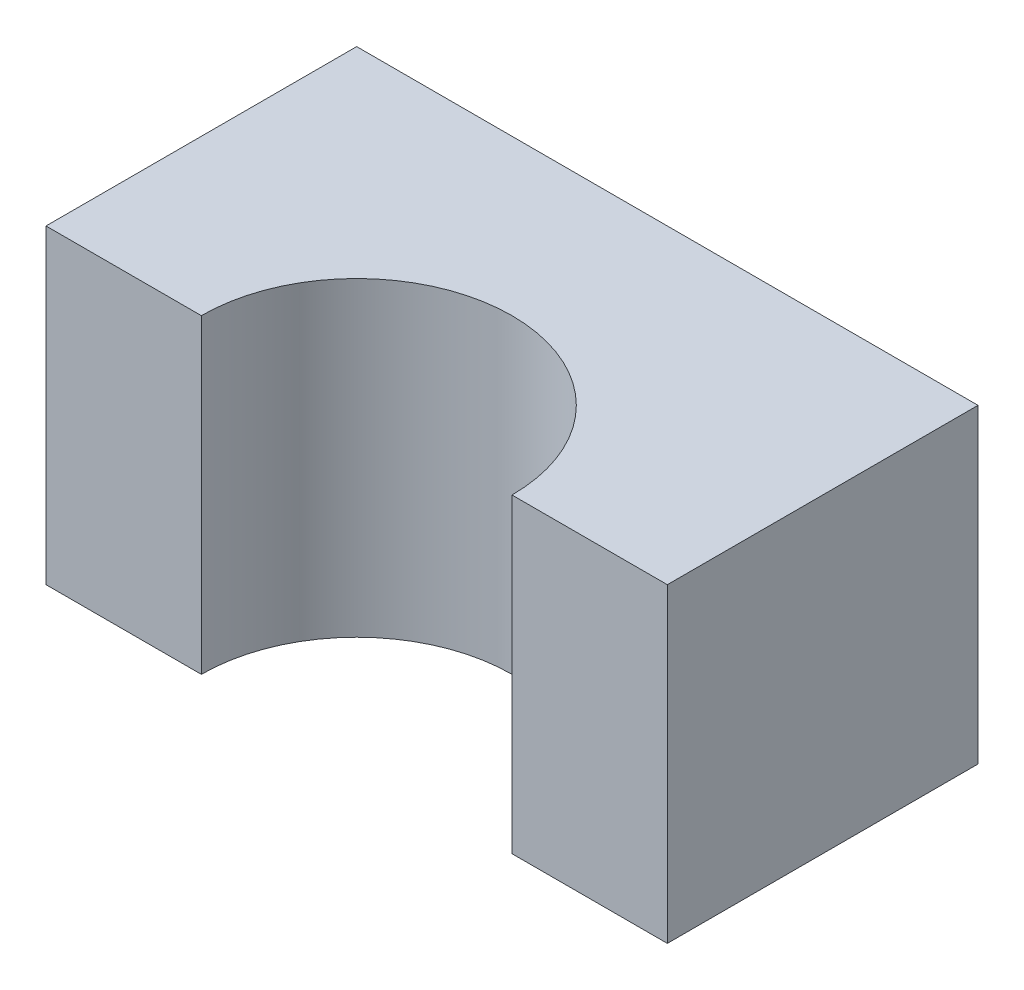
ISO-10303-21;
HEADER;
FILE_DESCRIPTION(('STEP AP214'),'2;1');
FILE_NAME('part.step','',(''),(''),'','','');
FILE_SCHEMA(('AUTOMOTIVE_DESIGN { 1 0 10303 214 1 1 1 1 }'));
ENDSEC;
DATA;
#1=APPLICATION_CONTEXT('core data for automotive mechanical design processes');
#2=APPLICATION_PROTOCOL_DEFINITION('international standard','automotive_design',2000,#1);
#3=PRODUCT_CONTEXT('',#1,'mechanical');
#4=PRODUCT('Part','Part','',(#3));
#5=PRODUCT_RELATED_PRODUCT_CATEGORY('part','',(#4));
#6=PRODUCT_DEFINITION_FORMATION('','',#4);
#7=PRODUCT_DEFINITION_CONTEXT('part definition',#1,'design');
#8=PRODUCT_DEFINITION('design','',#6,#7);
#9=PRODUCT_DEFINITION_SHAPE('','',#8);
#10=(LENGTH_UNIT() NAMED_UNIT(*) SI_UNIT(.MILLI.,.METRE.));
#11=(NAMED_UNIT(*) PLANE_ANGLE_UNIT() SI_UNIT($,.RADIAN.));
#12=(NAMED_UNIT(*) SI_UNIT($,.STERADIAN.) SOLID_ANGLE_UNIT());
#13=UNCERTAINTY_MEASURE_WITH_UNIT(LENGTH_MEASURE(1.E-05),#10,'distance_accuracy_value','');
#14=(GEOMETRIC_REPRESENTATION_CONTEXT(3) GLOBAL_UNCERTAINTY_ASSIGNED_CONTEXT((#13)) GLOBAL_UNIT_ASSIGNED_CONTEXT((#10,
#11,#12)) REPRESENTATION_CONTEXT('',''));
#15=CARTESIAN_POINT('',(0.,0.,0.));
#16=DIRECTION('',(0.,0.,1.));
#17=DIRECTION('',(1.,0.,0.));
#18=AXIS2_PLACEMENT_3D('',#15,#16,#17);
#19=CARTESIAN_POINT('',(-20.,20.,10.));
#20=DIRECTION('',(0.,0.,-1.));
#21=DIRECTION('',(-1.,0.,0.));
#22=AXIS2_PLACEMENT_3D('',#19,#20,#21);
#23=PLANE('',#22);
#24=DIRECTION('',(1.,0.,0.));
#25=VECTOR('',#24,1.);
#26=CARTESIAN_POINT('',(-20.,0.,10.));
#27=LINE('',#26,#25);
#28=CARTESIAN_POINT('',(-20.,0.,10.));
#29=VERTEX_POINT('',#28);
#30=CARTESIAN_POINT('',(-10.,0.,10.));
#31=VERTEX_POINT('',#30);
#32=EDGE_CURVE('E121',#29,#31,#27,.T.);
#33=ORIENTED_EDGE('',*,*,#32,.T.);
#34=DIRECTION('',(0.,1.,0.));
#35=VECTOR('',#34,1.);
#36=CARTESIAN_POINT('',(-10.,0.,10.));
#37=LINE('',#36,#35);
#38=CARTESIAN_POINT('',(-10.,20.,10.));
#39=VERTEX_POINT('',#38);
#40=EDGE_CURVE('E59',#31,#39,#37,.T.);
#41=ORIENTED_EDGE('',*,*,#40,.T.);
#42=DIRECTION('',(1.,0.,0.));
#43=VECTOR('',#42,1.);
#44=CARTESIAN_POINT('',(-20.,20.,10.));
#45=LINE('',#44,#43);
#46=CARTESIAN_POINT('',(-20.,20.,10.));
#47=VERTEX_POINT('',#46);
#48=EDGE_CURVE('E135',#47,#39,#45,.T.);
#49=ORIENTED_EDGE('',*,*,#48,.F.);
#50=DIRECTION('',(0.,-1.,0.));
#51=VECTOR('',#50,1.);
#52=CARTESIAN_POINT('',(-20.,20.,10.));
#53=LINE('',#52,#51);
#54=EDGE_CURVE('E134',#47,#29,#53,.T.);
#55=ORIENTED_EDGE('',*,*,#54,.T.);
#56=EDGE_LOOP('',(#33,#41,#49,#55));
#57=FACE_BOUND('',#56,.T.);
#58=ADVANCED_FACE('F43',(#57),#23,.F.);
#59=CARTESIAN_POINT('',(20.,20.,-10.));
#60=DIRECTION('',(-1.,0.,0.));
#61=DIRECTION('',(0.,0.,1.));
#62=AXIS2_PLACEMENT_3D('',#59,#60,#61);
#63=PLANE('',#62);
#64=DIRECTION('',(0.,0.,-1.));
#65=VECTOR('',#64,1.);
#66=CARTESIAN_POINT('',(20.,0.,-10.));
#67=LINE('',#66,#65);
#68=CARTESIAN_POINT('',(20.,0.,10.));
#69=VERTEX_POINT('',#68);
#70=CARTESIAN_POINT('',(20.,0.,-10.));
#71=VERTEX_POINT('',#70);
#72=EDGE_CURVE('E119',#69,#71,#67,.T.);
#73=ORIENTED_EDGE('',*,*,#72,.T.);
#74=DIRECTION('',(0.,-1.,0.));
#75=VECTOR('',#74,1.);
#76=CARTESIAN_POINT('',(20.,20.,-10.));
#77=LINE('',#76,#75);
#78=CARTESIAN_POINT('',(20.,20.,-10.));
#79=VERTEX_POINT('',#78);
#80=EDGE_CURVE('E11',#79,#71,#77,.T.);
#81=ORIENTED_EDGE('',*,*,#80,.F.);
#82=DIRECTION('',(0.,0.,-1.));
#83=VECTOR('',#82,1.);
#84=CARTESIAN_POINT('',(20.,20.,-10.));
#85=LINE('',#84,#83);
#86=CARTESIAN_POINT('',(20.,20.,10.));
#87=VERTEX_POINT('',#86);
#88=EDGE_CURVE('E126',#87,#79,#85,.T.);
#89=ORIENTED_EDGE('',*,*,#88,.F.);
#90=DIRECTION('',(0.,-1.,0.));
#91=VECTOR('',#90,1.);
#92=CARTESIAN_POINT('',(20.,20.,10.));
#93=LINE('',#92,#91);
#94=EDGE_CURVE('E131',#87,#69,#93,.T.);
#95=ORIENTED_EDGE('',*,*,#94,.T.);
#96=EDGE_LOOP('',(#73,#81,#89,#95));
#97=FACE_BOUND('',#96,.T.);
#98=ADVANCED_FACE('F45',(#97),#63,.F.);
#99=CARTESIAN_POINT('',(-20.,20.,-10.));
#100=DIRECTION('',(0.,0.,1.));
#101=DIRECTION('',(1.,0.,0.));
#102=AXIS2_PLACEMENT_3D('',#99,#100,#101);
#103=PLANE('',#102);
#104=DIRECTION('',(-1.,0.,0.));
#105=VECTOR('',#104,1.);
#106=CARTESIAN_POINT('',(-20.,0.,-10.));
#107=LINE('',#106,#105);
#108=CARTESIAN_POINT('',(-20.,0.,-10.));
#109=VERTEX_POINT('',#108);
#110=EDGE_CURVE('E127',#71,#109,#107,.T.);
#111=ORIENTED_EDGE('',*,*,#110,.T.);
#112=DIRECTION('',(0.,-1.,0.));
#113=VECTOR('',#112,1.);
#114=CARTESIAN_POINT('',(-20.,20.,-10.));
#115=LINE('',#114,#113);
#116=CARTESIAN_POINT('',(-20.,20.,-10.));
#117=VERTEX_POINT('',#116);
#118=EDGE_CURVE('E52',#117,#109,#115,.T.);
#119=ORIENTED_EDGE('',*,*,#118,.F.);
#120=DIRECTION('',(-1.,0.,0.));
#121=VECTOR('',#120,1.);
#122=CARTESIAN_POINT('',(-20.,20.,-10.));
#123=LINE('',#122,#121);
#124=EDGE_CURVE('E97',#79,#117,#123,.T.);
#125=ORIENTED_EDGE('',*,*,#124,.F.);
#126=ORIENTED_EDGE('',*,*,#80,.T.);
#127=EDGE_LOOP('',(#111,#119,#125,#126));
#128=FACE_BOUND('',#127,.T.);
#129=ADVANCED_FACE('F157',(#128),#103,.F.);
#130=CARTESIAN_POINT('',(-20.,20.,-10.));
#131=DIRECTION('',(1.,0.,0.));
#132=DIRECTION('',(0.,0.,-1.));
#133=AXIS2_PLACEMENT_3D('',#130,#131,#132);
#134=PLANE('',#133);
#135=DIRECTION('',(0.,0.,1.));
#136=VECTOR('',#135,1.);
#137=CARTESIAN_POINT('',(-20.,0.,-10.));
#138=LINE('',#137,#136);
#139=EDGE_CURVE('E122',#109,#29,#138,.T.);
#140=ORIENTED_EDGE('',*,*,#139,.T.);
#141=ORIENTED_EDGE('',*,*,#54,.F.);
#142=DIRECTION('',(0.,0.,1.));
#143=VECTOR('',#142,1.);
#144=CARTESIAN_POINT('',(-20.,20.,-10.));
#145=LINE('',#144,#143);
#146=EDGE_CURVE('E145',#117,#47,#145,.T.);
#147=ORIENTED_EDGE('',*,*,#146,.F.);
#148=ORIENTED_EDGE('',*,*,#118,.T.);
#149=EDGE_LOOP('',(#140,#141,#147,#148));
#150=FACE_BOUND('',#149,.T.);
#151=ADVANCED_FACE('F143',(#150),#134,.F.);
#152=CARTESIAN_POINT('',(10.,20.,10.));
#153=VERTEX_POINT('',#152);
#154=EDGE_CURVE('E68',#153,#87,#45,.T.);
#155=ORIENTED_EDGE('',*,*,#154,.F.);
#156=DIRECTION('',(0.,1.,0.));
#157=VECTOR('',#156,1.);
#158=CARTESIAN_POINT('',(10.,0.,10.));
#159=LINE('',#158,#157);
#160=CARTESIAN_POINT('',(10.,0.,10.));
#161=VERTEX_POINT('',#160);
#162=EDGE_CURVE('E106',#153,#161,#159,.F.);
#163=ORIENTED_EDGE('',*,*,#162,.T.);
#164=EDGE_CURVE('E90',#161,#69,#27,.T.);
#165=ORIENTED_EDGE('',*,*,#164,.T.);
#166=ORIENTED_EDGE('',*,*,#94,.F.);
#167=EDGE_LOOP('',(#155,#163,#165,#166));
#168=FACE_BOUND('',#167,.T.);
#169=ADVANCED_FACE('F113',(#168),#23,.F.);
#170=CARTESIAN_POINT('',(0.,20.,0.));
#171=DIRECTION('',(0.,1.,0.));
#172=DIRECTION('',(0.,0.,1.));
#173=AXIS2_PLACEMENT_3D('',#170,#171,#172);
#174=PLANE('',#173);
#175=CARTESIAN_POINT('',(0.,20.,10.));
#176=DIRECTION('',(0.,1.,0.));
#177=DIRECTION('',(0.,0.,1.));
#178=AXIS2_PLACEMENT_3D('',#175,#176,#177);
#179=CIRCLE('',#178,10.);
#180=EDGE_CURVE('E111',#153,#39,#179,.T.);
#181=ORIENTED_EDGE('',*,*,#180,.F.);
#182=ORIENTED_EDGE('',*,*,#154,.T.);
#183=ORIENTED_EDGE('',*,*,#88,.T.);
#184=ORIENTED_EDGE('',*,*,#124,.T.);
#185=ORIENTED_EDGE('',*,*,#146,.T.);
#186=ORIENTED_EDGE('',*,*,#48,.T.);
#187=EDGE_LOOP('',(#181,#182,#183,#184,#185,#186));
#188=FACE_BOUND('',#187,.T.);
#189=ADVANCED_FACE('F168',(#188),#174,.T.);
#190=CARTESIAN_POINT('',(0.,0.,0.));
#191=DIRECTION('',(0.,1.,0.));
#192=DIRECTION('',(0.,0.,1.));
#193=AXIS2_PLACEMENT_3D('',#190,#191,#192);
#194=PLANE('',#193);
#195=ORIENTED_EDGE('',*,*,#164,.F.);
#196=CARTESIAN_POINT('',(0.,0.,10.));
#197=DIRECTION('',(0.,1.,0.));
#198=DIRECTION('',(0.,0.,1.));
#199=AXIS2_PLACEMENT_3D('',#196,#197,#198);
#200=CIRCLE('',#199,10.);
#201=EDGE_CURVE('E104',#161,#31,#200,.T.);
#202=ORIENTED_EDGE('',*,*,#201,.T.);
#203=ORIENTED_EDGE('',*,*,#32,.F.);
#204=ORIENTED_EDGE('',*,*,#139,.F.);
#205=ORIENTED_EDGE('',*,*,#110,.F.);
#206=ORIENTED_EDGE('',*,*,#72,.F.);
#207=EDGE_LOOP('',(#195,#202,#203,#204,#205,#206));
#208=FACE_BOUND('',#207,.T.);
#209=ADVANCED_FACE('F117',(#208),#194,.F.);
#210=CARTESIAN_POINT('',(0.,0.,10.));
#211=DIRECTION('',(0.,1.,0.));
#212=DIRECTION('',(0.,0.,1.));
#213=AXIS2_PLACEMENT_3D('',#210,#211,#212);
#214=CYLINDRICAL_SURFACE('',#213,10.);
#215=ORIENTED_EDGE('',*,*,#201,.F.);
#216=ORIENTED_EDGE('',*,*,#162,.F.);
#217=ORIENTED_EDGE('',*,*,#180,.T.);
#218=ORIENTED_EDGE('',*,*,#40,.F.);
#219=EDGE_LOOP('',(#215,#216,#217,#218));
#220=FACE_BOUND('',#219,.T.);
#221=ADVANCED_FACE('F105',(#220),#214,.F.);
#222=CLOSED_SHELL('',(#58,#98,#129,#151,#169,#189,#209,#221));
#223=MANIFOLD_SOLID_BREP('B2',#222);
#224=ADVANCED_BREP_SHAPE_REPRESENTATION('',(#18,#223),#14);
#225=SHAPE_DEFINITION_REPRESENTATION(#9,#224);
ENDSEC;
END-ISO-10303-21;
